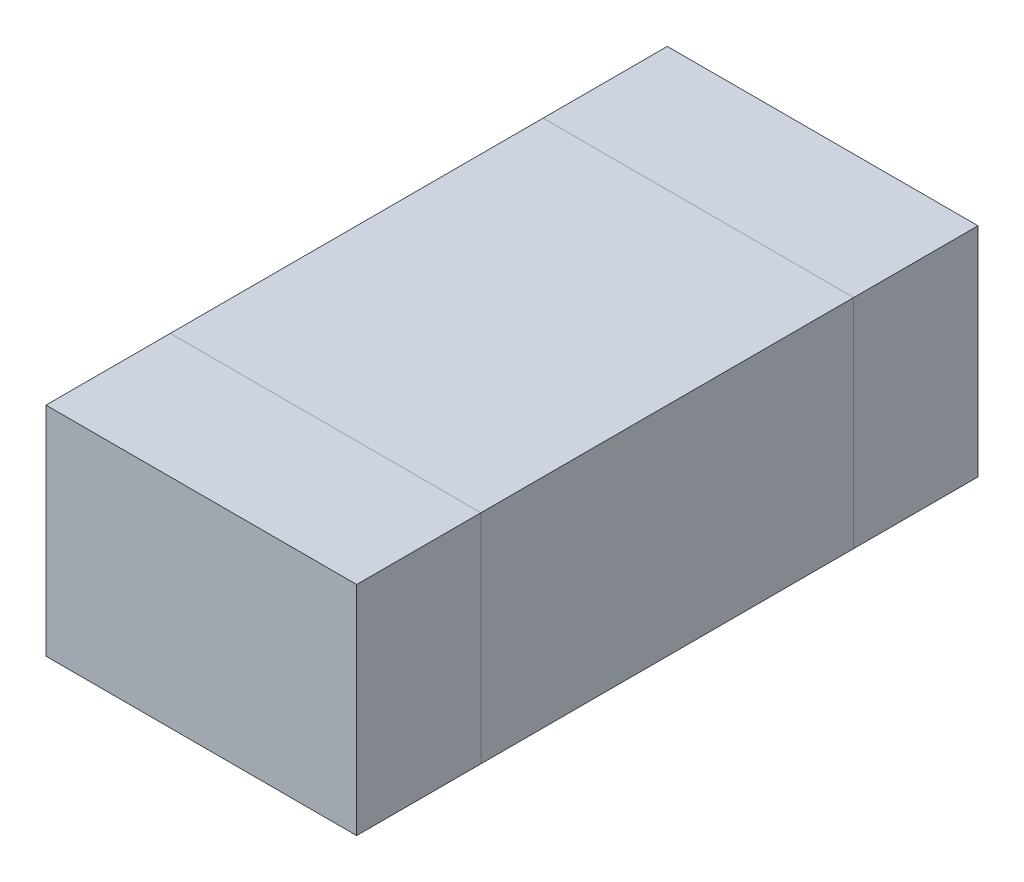
ISO-10303-21;
HEADER;
FILE_DESCRIPTION(('STEP AP214'),'2;1');
FILE_NAME('part.step','',(''),(''),'','','');
FILE_SCHEMA(('AUTOMOTIVE_DESIGN { 1 0 10303 214 1 1 1 1 }'));
ENDSEC;
DATA;
#1=APPLICATION_CONTEXT('core data for automotive mechanical design processes');
#2=APPLICATION_PROTOCOL_DEFINITION('international standard','automotive_design',2000,#1);
#3=PRODUCT_CONTEXT('',#1,'mechanical');
#4=PRODUCT('Part','Part','',(#3));
#5=PRODUCT_RELATED_PRODUCT_CATEGORY('part','',(#4));
#6=PRODUCT_DEFINITION_FORMATION('','',#4);
#7=PRODUCT_DEFINITION_CONTEXT('part definition',#1,'design');
#8=PRODUCT_DEFINITION('design','',#6,#7);
#9=PRODUCT_DEFINITION_SHAPE('','',#8);
#10=(LENGTH_UNIT() NAMED_UNIT(*) SI_UNIT(.MILLI.,.METRE.));
#11=(NAMED_UNIT(*) PLANE_ANGLE_UNIT() SI_UNIT($,.RADIAN.));
#12=(NAMED_UNIT(*) SI_UNIT($,.STERADIAN.) SOLID_ANGLE_UNIT());
#13=UNCERTAINTY_MEASURE_WITH_UNIT(LENGTH_MEASURE(1.E-05),#10,'distance_accuracy_value','');
#14=(GEOMETRIC_REPRESENTATION_CONTEXT(3) GLOBAL_UNCERTAINTY_ASSIGNED_CONTEXT((#13)) GLOBAL_UNIT_ASSIGNED_CONTEXT((#10,
#11,#12)) REPRESENTATION_CONTEXT('',''));
#15=CARTESIAN_POINT('',(0.,0.,0.));
#16=DIRECTION('',(0.,0.,1.));
#17=DIRECTION('',(1.,0.,0.));
#18=AXIS2_PLACEMENT_3D('',#15,#16,#17);
#19=CARTESIAN_POINT('',(-0.25,0.88851648071345,0.5));
#20=DIRECTION('',(0.,0.,1.));
#21=DIRECTION('',(1.,0.,0.));
#22=AXIS2_PLACEMENT_3D('',#19,#20,#21);
#23=PLANE('',#22);
#24=DIRECTION('',(0.,1.,0.));
#25=VECTOR('',#24,1.);
#26=CARTESIAN_POINT('',(-0.25,0.88851648071345,0.5));
#27=LINE('',#26,#25);
#28=CARTESIAN_POINT('',(-0.25,0.,0.5));
#29=VERTEX_POINT('',#28);
#30=CARTESIAN_POINT('',(-0.25,0.35,0.5));
#31=VERTEX_POINT('',#30);
#32=EDGE_CURVE('P0_E20',#29,#31,#27,.T.);
#33=ORIENTED_EDGE('',*,*,#32,.F.);
#34=DIRECTION('',(1.,0.,0.));
#35=VECTOR('',#34,1.);
#36=CARTESIAN_POINT('',(0.,0.,0.5));
#37=LINE('',#36,#35);
#38=CARTESIAN_POINT('',(0.25,0.,0.5));
#39=VERTEX_POINT('',#38);
#40=EDGE_CURVE('P0_E79',#29,#39,#37,.T.);
#41=ORIENTED_EDGE('',*,*,#40,.T.);
#42=DIRECTION('',(0.,1.,0.));
#43=VECTOR('',#42,1.);
#44=CARTESIAN_POINT('',(0.25,0.88851648071345,0.5));
#45=LINE('',#44,#43);
#46=CARTESIAN_POINT('',(0.25,0.35,0.5));
#47=VERTEX_POINT('',#46);
#48=EDGE_CURVE('P0_E68',#47,#39,#45,.F.);
#49=ORIENTED_EDGE('',*,*,#48,.F.);
#50=DIRECTION('',(1.,0.,0.));
#51=VECTOR('',#50,1.);
#52=CARTESIAN_POINT('',(0.,0.35,0.5));
#53=LINE('',#52,#51);
#54=EDGE_CURVE('P0_E56',#31,#47,#53,.T.);
#55=ORIENTED_EDGE('',*,*,#54,.F.);
#56=EDGE_LOOP('',(#33,#41,#49,#55));
#57=FACE_BOUND('',#56,.T.);
#58=ADVANCED_FACE('P0_F17',(#57),#23,.T.);
#59=CARTESIAN_POINT('',(-0.25,0.88851648071345,0.3));
#60=DIRECTION('',(-1.,0.,0.));
#61=DIRECTION('',(0.,0.,1.));
#62=AXIS2_PLACEMENT_3D('',#59,#60,#61);
#63=PLANE('',#62);
#64=DIRECTION('',(0.,1.,0.));
#65=VECTOR('',#64,1.);
#66=CARTESIAN_POINT('',(-0.25,0.88851648071345,0.3));
#67=LINE('',#66,#65);
#68=CARTESIAN_POINT('',(-0.25,0.,0.3));
#69=VERTEX_POINT('',#68);
#70=CARTESIAN_POINT('',(-0.25,0.35,0.3));
#71=VERTEX_POINT('',#70);
#72=EDGE_CURVE('P0_E83',#69,#71,#67,.T.);
#73=ORIENTED_EDGE('',*,*,#72,.F.);
#74=DIRECTION('',(0.,0.,1.));
#75=VECTOR('',#74,1.);
#76=CARTESIAN_POINT('',(-0.25,0.,0.));
#77=LINE('',#76,#75);
#78=EDGE_CURVE('P0_E65',#69,#29,#77,.T.);
#79=ORIENTED_EDGE('',*,*,#78,.T.);
#80=ORIENTED_EDGE('',*,*,#32,.T.);
#81=DIRECTION('',(0.,0.,1.));
#82=VECTOR('',#81,1.);
#83=CARTESIAN_POINT('',(-0.25,0.35,0.));
#84=LINE('',#83,#82);
#85=EDGE_CURVE('P0_E62',#71,#31,#84,.T.);
#86=ORIENTED_EDGE('',*,*,#85,.F.);
#87=EDGE_LOOP('',(#73,#79,#80,#86));
#88=FACE_BOUND('',#87,.T.);
#89=ADVANCED_FACE('P0_F61',(#88),#63,.T.);
#90=CARTESIAN_POINT('',(0.,0.35,0.));
#91=DIRECTION('',(0.,1.,0.));
#92=DIRECTION('',(0.,0.,1.));
#93=AXIS2_PLACEMENT_3D('',#90,#91,#92);
#94=PLANE('',#93);
#95=DIRECTION('',(0.,0.,-1.));
#96=VECTOR('',#95,1.);
#97=CARTESIAN_POINT('',(0.25,0.35,0.3));
#98=LINE('',#97,#96);
#99=CARTESIAN_POINT('',(0.25,0.35,0.3));
#100=VERTEX_POINT('',#99);
#101=EDGE_CURVE('P0_E70',#100,#47,#98,.F.);
#102=ORIENTED_EDGE('',*,*,#101,.F.);
#103=DIRECTION('',(-1.,0.,0.));
#104=VECTOR('',#103,1.);
#105=CARTESIAN_POINT('',(-0.25,0.35,0.3));
#106=LINE('',#105,#104);
#107=EDGE_CURVE('P0_E74',#71,#100,#106,.F.);
#108=ORIENTED_EDGE('',*,*,#107,.F.);
#109=ORIENTED_EDGE('',*,*,#85,.T.);
#110=ORIENTED_EDGE('',*,*,#54,.T.);
#111=EDGE_LOOP('',(#102,#108,#109,#110));
#112=FACE_BOUND('',#111,.T.);
#113=ADVANCED_FACE('P0_F72',(#112),#94,.T.);
#114=CARTESIAN_POINT('',(0.25,0.88851648071345,0.3));
#115=DIRECTION('',(1.,0.,0.));
#116=DIRECTION('',(0.,0.,-1.));
#117=AXIS2_PLACEMENT_3D('',#114,#115,#116);
#118=PLANE('',#117);
#119=ORIENTED_EDGE('',*,*,#48,.T.);
#120=DIRECTION('',(0.,0.,1.));
#121=VECTOR('',#120,1.);
#122=CARTESIAN_POINT('',(0.25,0.,0.));
#123=LINE('',#122,#121);
#124=CARTESIAN_POINT('',(0.25,0.,0.3));
#125=VERTEX_POINT('',#124);
#126=EDGE_CURVE('P0_E35',#39,#125,#123,.F.);
#127=ORIENTED_EDGE('',*,*,#126,.T.);
#128=DIRECTION('',(0.,1.,0.));
#129=VECTOR('',#128,1.);
#130=CARTESIAN_POINT('',(0.25,0.88851648071345,0.3));
#131=LINE('',#130,#129);
#132=EDGE_CURVE('P0_E26',#100,#125,#131,.F.);
#133=ORIENTED_EDGE('',*,*,#132,.F.);
#134=ORIENTED_EDGE('',*,*,#101,.T.);
#135=EDGE_LOOP('',(#119,#127,#133,#134));
#136=FACE_BOUND('',#135,.T.);
#137=ADVANCED_FACE('P0_F89',(#136),#118,.T.);
#138=CARTESIAN_POINT('',(0.,0.,0.));
#139=DIRECTION('',(0.,1.,0.));
#140=DIRECTION('',(0.,0.,1.));
#141=AXIS2_PLACEMENT_3D('',#138,#139,#140);
#142=PLANE('',#141);
#143=DIRECTION('',(-1.,0.,0.));
#144=VECTOR('',#143,1.);
#145=CARTESIAN_POINT('',(-0.25,0.,0.3));
#146=LINE('',#145,#144);
#147=EDGE_CURVE('P0_E11',#125,#69,#146,.T.);
#148=ORIENTED_EDGE('',*,*,#147,.F.);
#149=ORIENTED_EDGE('',*,*,#126,.F.);
#150=ORIENTED_EDGE('',*,*,#40,.F.);
#151=ORIENTED_EDGE('',*,*,#78,.F.);
#152=EDGE_LOOP('',(#148,#149,#150,#151));
#153=FACE_BOUND('',#152,.T.);
#154=ADVANCED_FACE('P0_F91',(#153),#142,.F.);
#155=CARTESIAN_POINT('',(-0.25,0.88851648071345,0.3));
#156=DIRECTION('',(0.,0.,-1.));
#157=DIRECTION('',(-1.,0.,0.));
#158=AXIS2_PLACEMENT_3D('',#155,#156,#157);
#159=PLANE('',#158);
#160=ORIENTED_EDGE('',*,*,#132,.T.);
#161=ORIENTED_EDGE('',*,*,#147,.T.);
#162=ORIENTED_EDGE('',*,*,#72,.T.);
#163=ORIENTED_EDGE('',*,*,#107,.T.);
#164=EDGE_LOOP('',(#160,#161,#162,#163));
#165=FACE_BOUND('',#164,.T.);
#166=ADVANCED_FACE('P0_F88',(#165),#159,.T.);
#167=CLOSED_SHELL('',(#58,#89,#113,#137,#154,#166));
#168=MANIFOLD_SOLID_BREP('P0_B1',#167);
#169=CARTESIAN_POINT('',(0.,0.,0.));
#170=DIRECTION('',(0.,1.,0.));
#171=DIRECTION('',(0.,0.,1.));
#172=AXIS2_PLACEMENT_3D('',#169,#170,#171);
#173=PLANE('',#172);
#174=DIRECTION('',(-1.,0.,0.));
#175=VECTOR('',#174,1.);
#176=CARTESIAN_POINT('',(-0.25,0.,0.3));
#177=LINE('',#176,#175);
#178=CARTESIAN_POINT('',(0.25,0.,0.3));
#179=VERTEX_POINT('',#178);
#180=CARTESIAN_POINT('',(-0.25,0.,0.3));
#181=VERTEX_POINT('',#180);
#182=EDGE_CURVE('P1_E81',#179,#181,#177,.T.);
#183=ORIENTED_EDGE('',*,*,#182,.T.);
#184=DIRECTION('',(0.,0.,-1.));
#185=VECTOR('',#184,1.);
#186=CARTESIAN_POINT('',(-0.25,0.,-0.3));
#187=LINE('',#186,#185);
#188=CARTESIAN_POINT('',(-0.25,0.,-0.3));
#189=VERTEX_POINT('',#188);
#190=EDGE_CURVE('P1_E68',#181,#189,#187,.T.);
#191=ORIENTED_EDGE('',*,*,#190,.T.);
#192=DIRECTION('',(1.,0.,0.));
#193=VECTOR('',#192,1.);
#194=CARTESIAN_POINT('',(-0.25,0.,-0.3));
#195=LINE('',#194,#193);
#196=CARTESIAN_POINT('',(0.25,0.,-0.3));
#197=VERTEX_POINT('',#196);
#198=EDGE_CURVE('P1_E55',#189,#197,#195,.T.);
#199=ORIENTED_EDGE('',*,*,#198,.T.);
#200=DIRECTION('',(0.,0.,1.));
#201=VECTOR('',#200,1.);
#202=CARTESIAN_POINT('',(0.25,0.,-0.3));
#203=LINE('',#202,#201);
#204=EDGE_CURVE('P1_E20',#197,#179,#203,.T.);
#205=ORIENTED_EDGE('',*,*,#204,.T.);
#206=EDGE_LOOP('',(#183,#191,#199,#205));
#207=FACE_BOUND('',#206,.T.);
#208=ADVANCED_FACE('P1_F17',(#207),#173,.F.);
#209=CARTESIAN_POINT('',(0.25,0.35,-0.3));
#210=DIRECTION('',(-1.,0.,0.));
#211=DIRECTION('',(0.,0.,1.));
#212=AXIS2_PLACEMENT_3D('',#209,#210,#211);
#213=PLANE('',#212);
#214=DIRECTION('',(0.,1.,0.));
#215=VECTOR('',#214,1.);
#216=CARTESIAN_POINT('',(0.25,0.35,-0.3));
#217=LINE('',#216,#215);
#218=CARTESIAN_POINT('',(0.25,0.35,-0.3));
#219=VERTEX_POINT('',#218);
#220=EDGE_CURVE('P1_E61',#197,#219,#217,.T.);
#221=ORIENTED_EDGE('',*,*,#220,.T.);
#222=DIRECTION('',(0.,0.,1.));
#223=VECTOR('',#222,1.);
#224=CARTESIAN_POINT('',(0.25,0.35,0.));
#225=LINE('',#224,#223);
#226=CARTESIAN_POINT('',(0.25,0.35,0.3));
#227=VERTEX_POINT('',#226);
#228=EDGE_CURVE('P1_E83',#227,#219,#225,.F.);
#229=ORIENTED_EDGE('',*,*,#228,.F.);
#230=DIRECTION('',(0.,1.,0.));
#231=VECTOR('',#230,1.);
#232=CARTESIAN_POINT('',(0.25,0.35,0.3));
#233=LINE('',#232,#231);
#234=EDGE_CURVE('P1_E64',#227,#179,#233,.F.);
#235=ORIENTED_EDGE('',*,*,#234,.T.);
#236=ORIENTED_EDGE('',*,*,#204,.F.);
#237=EDGE_LOOP('',(#221,#229,#235,#236));
#238=FACE_BOUND('',#237,.T.);
#239=ADVANCED_FACE('P1_F60',(#238),#213,.F.);
#240=CARTESIAN_POINT('',(-0.25,0.35,-0.3));
#241=DIRECTION('',(0.,0.,1.));
#242=DIRECTION('',(1.,0.,0.));
#243=AXIS2_PLACEMENT_3D('',#240,#241,#242);
#244=PLANE('',#243);
#245=DIRECTION('',(0.,1.,0.));
#246=VECTOR('',#245,1.);
#247=CARTESIAN_POINT('',(-0.25,0.35,-0.3));
#248=LINE('',#247,#246);
#249=CARTESIAN_POINT('',(-0.25,0.35,-0.3));
#250=VERTEX_POINT('',#249);
#251=EDGE_CURVE('P1_E70',#189,#250,#248,.T.);
#252=ORIENTED_EDGE('',*,*,#251,.T.);
#253=DIRECTION('',(1.,0.,0.));
#254=VECTOR('',#253,1.);
#255=CARTESIAN_POINT('',(0.,0.35,-0.3));
#256=LINE('',#255,#254);
#257=EDGE_CURVE('P1_E74',#219,#250,#256,.F.);
#258=ORIENTED_EDGE('',*,*,#257,.F.);
#259=ORIENTED_EDGE('',*,*,#220,.F.);
#260=ORIENTED_EDGE('',*,*,#198,.F.);
#261=EDGE_LOOP('',(#252,#258,#259,#260));
#262=FACE_BOUND('',#261,.T.);
#263=ADVANCED_FACE('P1_F72',(#262),#244,.F.);
#264=CARTESIAN_POINT('',(-0.25,0.35,-0.3));
#265=DIRECTION('',(1.,0.,0.));
#266=DIRECTION('',(0.,0.,-1.));
#267=AXIS2_PLACEMENT_3D('',#264,#265,#266);
#268=PLANE('',#267);
#269=DIRECTION('',(0.,1.,0.));
#270=VECTOR('',#269,1.);
#271=CARTESIAN_POINT('',(-0.25,0.35,0.3));
#272=LINE('',#271,#270);
#273=CARTESIAN_POINT('',(-0.25,0.35,0.3));
#274=VERTEX_POINT('',#273);
#275=EDGE_CURVE('P1_E35',#181,#274,#272,.T.);
#276=ORIENTED_EDGE('',*,*,#275,.T.);
#277=DIRECTION('',(0.,0.,1.));
#278=VECTOR('',#277,1.);
#279=CARTESIAN_POINT('',(-0.25,0.35,0.));
#280=LINE('',#279,#278);
#281=EDGE_CURVE('P1_E26',#250,#274,#280,.T.);
#282=ORIENTED_EDGE('',*,*,#281,.F.);
#283=ORIENTED_EDGE('',*,*,#251,.F.);
#284=ORIENTED_EDGE('',*,*,#190,.F.);
#285=EDGE_LOOP('',(#276,#282,#283,#284));
#286=FACE_BOUND('',#285,.T.);
#287=ADVANCED_FACE('P1_F89',(#286),#268,.F.);
#288=CARTESIAN_POINT('',(-0.25,0.35,0.3));
#289=DIRECTION('',(0.,0.,-1.));
#290=DIRECTION('',(-1.,0.,0.));
#291=AXIS2_PLACEMENT_3D('',#288,#289,#290);
#292=PLANE('',#291);
#293=ORIENTED_EDGE('',*,*,#234,.F.);
#294=DIRECTION('',(1.,0.,0.));
#295=VECTOR('',#294,1.);
#296=CARTESIAN_POINT('',(0.,0.35,0.3));
#297=LINE('',#296,#295);
#298=EDGE_CURVE('P1_E11',#274,#227,#297,.T.);
#299=ORIENTED_EDGE('',*,*,#298,.F.);
#300=ORIENTED_EDGE('',*,*,#275,.F.);
#301=ORIENTED_EDGE('',*,*,#182,.F.);
#302=EDGE_LOOP('',(#293,#299,#300,#301));
#303=FACE_BOUND('',#302,.T.);
#304=ADVANCED_FACE('P1_F91',(#303),#292,.F.);
#305=CARTESIAN_POINT('',(0.,0.35,0.));
#306=DIRECTION('',(0.,1.,0.));
#307=DIRECTION('',(0.,0.,1.));
#308=AXIS2_PLACEMENT_3D('',#305,#306,#307);
#309=PLANE('',#308);
#310=ORIENTED_EDGE('',*,*,#281,.T.);
#311=ORIENTED_EDGE('',*,*,#298,.T.);
#312=ORIENTED_EDGE('',*,*,#228,.T.);
#313=ORIENTED_EDGE('',*,*,#257,.T.);
#314=EDGE_LOOP('',(#310,#311,#312,#313));
#315=FACE_BOUND('',#314,.T.);
#316=ADVANCED_FACE('P1_F88',(#315),#309,.T.);
#317=CLOSED_SHELL('',(#208,#239,#263,#287,#304,#316));
#318=MANIFOLD_SOLID_BREP('P1_B1',#317);
#319=CARTESIAN_POINT('',(-0.25,0.88851648071345,-0.3));
#320=DIRECTION('',(0.,0.,1.));
#321=DIRECTION('',(1.,0.,0.));
#322=AXIS2_PLACEMENT_3D('',#319,#320,#321);
#323=PLANE('',#322);
#324=DIRECTION('',(0.,1.,0.));
#325=VECTOR('',#324,1.);
#326=CARTESIAN_POINT('',(-0.25,0.88851648071345,-0.3));
#327=LINE('',#326,#325);
#328=CARTESIAN_POINT('',(-0.25,0.,-0.3));
#329=VERTEX_POINT('',#328);
#330=CARTESIAN_POINT('',(-0.25,0.35,-0.3));
#331=VERTEX_POINT('',#330);
#332=EDGE_CURVE('P2_E20',#329,#331,#327,.T.);
#333=ORIENTED_EDGE('',*,*,#332,.F.);
#334=DIRECTION('',(1.,0.,0.));
#335=VECTOR('',#334,1.);
#336=CARTESIAN_POINT('',(0.,0.,-0.3));
#337=LINE('',#336,#335);
#338=CARTESIAN_POINT('',(0.25,0.,-0.3));
#339=VERTEX_POINT('',#338);
#340=EDGE_CURVE('P2_E81',#339,#329,#337,.F.);
#341=ORIENTED_EDGE('',*,*,#340,.F.);
#342=DIRECTION('',(0.,1.,0.));
#343=VECTOR('',#342,1.);
#344=CARTESIAN_POINT('',(0.25,0.88851648071345,-0.3));
#345=LINE('',#344,#343);
#346=CARTESIAN_POINT('',(0.25,0.35,-0.3));
#347=VERTEX_POINT('',#346);
#348=EDGE_CURVE('P2_E68',#347,#339,#345,.F.);
#349=ORIENTED_EDGE('',*,*,#348,.F.);
#350=DIRECTION('',(1.,0.,0.));
#351=VECTOR('',#350,1.);
#352=CARTESIAN_POINT('',(0.,0.35,-0.3));
#353=LINE('',#352,#351);
#354=EDGE_CURVE('P2_E55',#331,#347,#353,.T.);
#355=ORIENTED_EDGE('',*,*,#354,.F.);
#356=EDGE_LOOP('',(#333,#341,#349,#355));
#357=FACE_BOUND('',#356,.T.);
#358=ADVANCED_FACE('P2_F17',(#357),#323,.T.);
#359=CARTESIAN_POINT('',(-0.25,0.88851648071345,-0.3));
#360=DIRECTION('',(-1.,0.,0.));
#361=DIRECTION('',(0.,0.,1.));
#362=AXIS2_PLACEMENT_3D('',#359,#360,#361);
#363=PLANE('',#362);
#364=DIRECTION('',(0.,1.,0.));
#365=VECTOR('',#364,1.);
#366=CARTESIAN_POINT('',(-0.25,0.88851648071345,-0.5));
#367=LINE('',#366,#365);
#368=CARTESIAN_POINT('',(-0.25,0.,-0.5));
#369=VERTEX_POINT('',#368);
#370=CARTESIAN_POINT('',(-0.25,0.35,-0.5));
#371=VERTEX_POINT('',#370);
#372=EDGE_CURVE('P2_E83',#369,#371,#367,.T.);
#373=ORIENTED_EDGE('',*,*,#372,.F.);
#374=DIRECTION('',(0.,0.,-1.));
#375=VECTOR('',#374,1.);
#376=CARTESIAN_POINT('',(-0.25,0.,0.));
#377=LINE('',#376,#375);
#378=EDGE_CURVE('P2_E64',#329,#369,#377,.T.);
#379=ORIENTED_EDGE('',*,*,#378,.F.);
#380=ORIENTED_EDGE('',*,*,#332,.T.);
#381=DIRECTION('',(0.,0.,1.));
#382=VECTOR('',#381,1.);
#383=CARTESIAN_POINT('',(-0.25,0.35,0.));
#384=LINE('',#383,#382);
#385=EDGE_CURVE('P2_E61',#371,#331,#384,.T.);
#386=ORIENTED_EDGE('',*,*,#385,.F.);
#387=EDGE_LOOP('',(#373,#379,#380,#386));
#388=FACE_BOUND('',#387,.T.);
#389=ADVANCED_FACE('P2_F60',(#388),#363,.T.);
#390=CARTESIAN_POINT('',(0.,0.35,0.));
#391=DIRECTION('',(0.,1.,0.));
#392=DIRECTION('',(0.,0.,1.));
#393=AXIS2_PLACEMENT_3D('',#390,#391,#392);
#394=PLANE('',#393);
#395=DIRECTION('',(0.,0.,-1.));
#396=VECTOR('',#395,1.);
#397=CARTESIAN_POINT('',(0.25,0.35,-0.3));
#398=LINE('',#397,#396);
#399=CARTESIAN_POINT('',(0.25,0.35,-0.5));
#400=VERTEX_POINT('',#399);
#401=EDGE_CURVE('P2_E70',#400,#347,#398,.F.);
#402=ORIENTED_EDGE('',*,*,#401,.F.);
#403=DIRECTION('',(-1.,0.,0.));
#404=VECTOR('',#403,1.);
#405=CARTESIAN_POINT('',(-0.25,0.35,-0.5));
#406=LINE('',#405,#404);
#407=EDGE_CURVE('P2_E74',#371,#400,#406,.F.);
#408=ORIENTED_EDGE('',*,*,#407,.F.);
#409=ORIENTED_EDGE('',*,*,#385,.T.);
#410=ORIENTED_EDGE('',*,*,#354,.T.);
#411=EDGE_LOOP('',(#402,#408,#409,#410));
#412=FACE_BOUND('',#411,.T.);
#413=ADVANCED_FACE('P2_F72',(#412),#394,.T.);
#414=CARTESIAN_POINT('',(0.25,0.88851648071345,-0.3));
#415=DIRECTION('',(1.,0.,0.));
#416=DIRECTION('',(0.,0.,-1.));
#417=AXIS2_PLACEMENT_3D('',#414,#415,#416);
#418=PLANE('',#417);
#419=ORIENTED_EDGE('',*,*,#348,.T.);
#420=DIRECTION('',(0.,0.,-1.));
#421=VECTOR('',#420,1.);
#422=CARTESIAN_POINT('',(0.25,0.,0.));
#423=LINE('',#422,#421);
#424=CARTESIAN_POINT('',(0.25,0.,-0.5));
#425=VERTEX_POINT('',#424);
#426=EDGE_CURVE('P2_E35',#425,#339,#423,.F.);
#427=ORIENTED_EDGE('',*,*,#426,.F.);
#428=DIRECTION('',(0.,1.,0.));
#429=VECTOR('',#428,1.);
#430=CARTESIAN_POINT('',(0.25,0.88851648071345,-0.5));
#431=LINE('',#430,#429);
#432=EDGE_CURVE('P2_E26',#400,#425,#431,.F.);
#433=ORIENTED_EDGE('',*,*,#432,.F.);
#434=ORIENTED_EDGE('',*,*,#401,.T.);
#435=EDGE_LOOP('',(#419,#427,#433,#434));
#436=FACE_BOUND('',#435,.T.);
#437=ADVANCED_FACE('P2_F89',(#436),#418,.T.);
#438=CARTESIAN_POINT('',(0.,0.,0.));
#439=DIRECTION('',(0.,-1.,0.));
#440=DIRECTION('',(0.,0.,-1.));
#441=AXIS2_PLACEMENT_3D('',#438,#439,#440);
#442=PLANE('',#441);
#443=ORIENTED_EDGE('',*,*,#426,.T.);
#444=ORIENTED_EDGE('',*,*,#340,.T.);
#445=ORIENTED_EDGE('',*,*,#378,.T.);
#446=DIRECTION('',(-1.,0.,0.));
#447=VECTOR('',#446,1.);
#448=CARTESIAN_POINT('',(-0.25,0.,-0.5));
#449=LINE('',#448,#447);
#450=EDGE_CURVE('P2_E11',#425,#369,#449,.T.);
#451=ORIENTED_EDGE('',*,*,#450,.F.);
#452=EDGE_LOOP('',(#443,#444,#445,#451));
#453=FACE_BOUND('',#452,.T.);
#454=ADVANCED_FACE('P2_F91',(#453),#442,.T.);
#455=CARTESIAN_POINT('',(-0.25,0.88851648071345,-0.5));
#456=DIRECTION('',(0.,0.,-1.));
#457=DIRECTION('',(-1.,0.,0.));
#458=AXIS2_PLACEMENT_3D('',#455,#456,#457);
#459=PLANE('',#458);
#460=ORIENTED_EDGE('',*,*,#432,.T.);
#461=ORIENTED_EDGE('',*,*,#450,.T.);
#462=ORIENTED_EDGE('',*,*,#372,.T.);
#463=ORIENTED_EDGE('',*,*,#407,.T.);
#464=EDGE_LOOP('',(#460,#461,#462,#463));
#465=FACE_BOUND('',#464,.T.);
#466=ADVANCED_FACE('P2_F88',(#465),#459,.T.);
#467=CLOSED_SHELL('',(#358,#389,#413,#437,#454,#466));
#468=MANIFOLD_SOLID_BREP('P2_B1',#467);
#469=ADVANCED_BREP_SHAPE_REPRESENTATION('',(#18,#168,#318,#468),#14);
#470=SHAPE_DEFINITION_REPRESENTATION(#9,#469);
ENDSEC;
END-ISO-10303-21;
